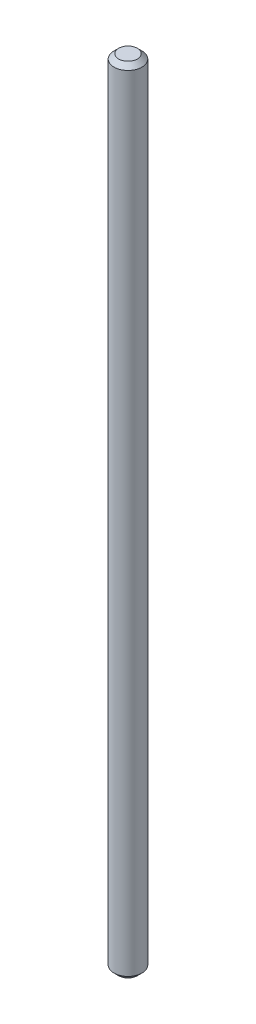
ISO-10303-21;
HEADER;
FILE_DESCRIPTION(('STEP AP214'),'2;1');
FILE_NAME('part.step','',(''),(''),'','','');
FILE_SCHEMA(('AUTOMOTIVE_DESIGN { 1 0 10303 214 1 1 1 1 }'));
ENDSEC;
DATA;
#1=APPLICATION_CONTEXT('core data for automotive mechanical design processes');
#2=APPLICATION_PROTOCOL_DEFINITION('international standard','automotive_design',2000,#1);
#3=PRODUCT_CONTEXT('',#1,'mechanical');
#4=PRODUCT('Part','Part','',(#3));
#5=PRODUCT_RELATED_PRODUCT_CATEGORY('part','',(#4));
#6=PRODUCT_DEFINITION_FORMATION('','',#4);
#7=PRODUCT_DEFINITION_CONTEXT('part definition',#1,'design');
#8=PRODUCT_DEFINITION('design','',#6,#7);
#9=PRODUCT_DEFINITION_SHAPE('','',#8);
#10=(LENGTH_UNIT() NAMED_UNIT(*) SI_UNIT(.MILLI.,.METRE.));
#11=(NAMED_UNIT(*) PLANE_ANGLE_UNIT() SI_UNIT($,.RADIAN.));
#12=(NAMED_UNIT(*) SI_UNIT($,.STERADIAN.) SOLID_ANGLE_UNIT());
#13=UNCERTAINTY_MEASURE_WITH_UNIT(LENGTH_MEASURE(1.E-05),#10,'distance_accuracy_value','');
#14=(GEOMETRIC_REPRESENTATION_CONTEXT(3) GLOBAL_UNCERTAINTY_ASSIGNED_CONTEXT((#13)) GLOBAL_UNIT_ASSIGNED_CONTEXT((#10,
#11,#12)) REPRESENTATION_CONTEXT('',''));
#15=CARTESIAN_POINT('',(0.,0.,0.));
#16=DIRECTION('',(0.,0.,1.));
#17=DIRECTION('',(1.,0.,0.));
#18=AXIS2_PLACEMENT_3D('',#15,#16,#17);
#19=CARTESIAN_POINT('',(0.,85.,0.));
#20=DIRECTION('',(0.,-1.,0.));
#21=DIRECTION('',(0.,0.,-1.));
#22=AXIS2_PLACEMENT_3D('',#19,#20,#21);
#23=CYLINDRICAL_SURFACE('',#22,1.5);
#24=CARTESIAN_POINT('',(0.,84.5,0.));
#25=DIRECTION('',(0.,1.,0.));
#26=DIRECTION('',(0.,0.,1.));
#27=AXIS2_PLACEMENT_3D('',#24,#25,#26);
#28=CIRCLE('',#27,1.5);
#29=CARTESIAN_POINT('',(0.,84.5,1.5));
#30=VERTEX_POINT('',#29);
#31=EDGE_CURVE('E53',#30,#30,#28,.F.);
#32=ORIENTED_EDGE('',*,*,#31,.T.);
#33=EDGE_LOOP('',(#32));
#34=FACE_BOUND('',#33,.T.);
#35=CARTESIAN_POINT('',(0.,0.500000000000028,0.));
#36=DIRECTION('',(0.,1.,0.));
#37=DIRECTION('',(0.,0.,1.));
#38=AXIS2_PLACEMENT_3D('',#35,#36,#37);
#39=CIRCLE('',#38,1.5);
#40=CARTESIAN_POINT('',(0.,0.500000000000028,1.5));
#41=VERTEX_POINT('',#40);
#42=EDGE_CURVE('E57',#41,#41,#39,.T.);
#43=ORIENTED_EDGE('',*,*,#42,.T.);
#44=EDGE_LOOP('',(#43));
#45=FACE_BOUND('',#44,.T.);
#46=ADVANCED_FACE('F46',(#34,#45),#23,.T.);
#47=CARTESIAN_POINT('',(0.,85.,0.));
#48=DIRECTION('',(0.,1.,0.));
#49=DIRECTION('',(0.,0.,1.));
#50=AXIS2_PLACEMENT_3D('',#47,#48,#49);
#51=PLANE('',#50);
#52=CARTESIAN_POINT('',(0.,85.,0.));
#53=DIRECTION('',(0.,1.,0.));
#54=DIRECTION('',(0.,0.,1.));
#55=AXIS2_PLACEMENT_3D('',#52,#53,#54);
#56=CIRCLE('',#55,1.00000000000001);
#57=CARTESIAN_POINT('',(0.,85.,1.00000000000001));
#58=VERTEX_POINT('',#57);
#59=EDGE_CURVE('E61',#58,#58,#56,.T.);
#60=ORIENTED_EDGE('',*,*,#59,.T.);
#61=EDGE_LOOP('',(#60));
#62=FACE_BOUND('',#61,.T.);
#63=ADVANCED_FACE('F67',(#62),#51,.T.);
#64=CARTESIAN_POINT('',(0.,0.,0.));
#65=DIRECTION('',(0.,1.,0.));
#66=DIRECTION('',(0.,0.,1.));
#67=AXIS2_PLACEMENT_3D('',#64,#65,#66);
#68=PLANE('',#67);
#69=CARTESIAN_POINT('',(0.,0.,0.));
#70=DIRECTION('',(0.,1.,0.));
#71=DIRECTION('',(0.,0.,1.));
#72=AXIS2_PLACEMENT_3D('',#69,#70,#71);
#73=CIRCLE('',#72,0.99999999999998);
#74=CARTESIAN_POINT('',(0.,0.,0.999999999999983));
#75=VERTEX_POINT('',#74);
#76=EDGE_CURVE('E12',#75,#75,#73,.F.);
#77=ORIENTED_EDGE('',*,*,#76,.T.);
#78=EDGE_LOOP('',(#77));
#79=FACE_BOUND('',#78,.T.);
#80=ADVANCED_FACE('F71',(#79),#68,.F.);
#81=CARTESIAN_POINT('',(0.,85.,0.));
#82=DIRECTION('',(0.,-1.,0.));
#83=DIRECTION('',(0.,0.,-1.));
#84=AXIS2_PLACEMENT_3D('',#81,#82,#83);
#85=CONICAL_SURFACE('',#84,1.00000000000001,0.785398163397454);
#86=ORIENTED_EDGE('',*,*,#31,.F.);
#87=EDGE_LOOP('',(#86));
#88=FACE_BOUND('',#87,.T.);
#89=ORIENTED_EDGE('',*,*,#59,.F.);
#90=EDGE_LOOP('',(#89));
#91=FACE_BOUND('',#90,.T.);
#92=ADVANCED_FACE('F69',(#88,#91),#85,.T.);
#93=CARTESIAN_POINT('',(0.,0.500000000000028,0.));
#94=DIRECTION('',(0.,1.,0.));
#95=DIRECTION('',(0.,0.,1.));
#96=AXIS2_PLACEMENT_3D('',#93,#94,#95);
#97=CONICAL_SURFACE('',#96,1.5,0.78539816339744);
#98=ORIENTED_EDGE('',*,*,#76,.F.);
#99=EDGE_LOOP('',(#98));
#100=FACE_BOUND('',#99,.T.);
#101=ORIENTED_EDGE('',*,*,#42,.F.);
#102=EDGE_LOOP('',(#101));
#103=FACE_BOUND('',#102,.T.);
#104=ADVANCED_FACE('F48',(#100,#103),#97,.T.);
#105=CLOSED_SHELL('',(#46,#63,#80,#92,#104));
#106=MANIFOLD_SOLID_BREP('B2',#105);
#107=ADVANCED_BREP_SHAPE_REPRESENTATION('',(#18,#106),#14);
#108=SHAPE_DEFINITION_REPRESENTATION(#9,#107);
ENDSEC;
END-ISO-10303-21;
